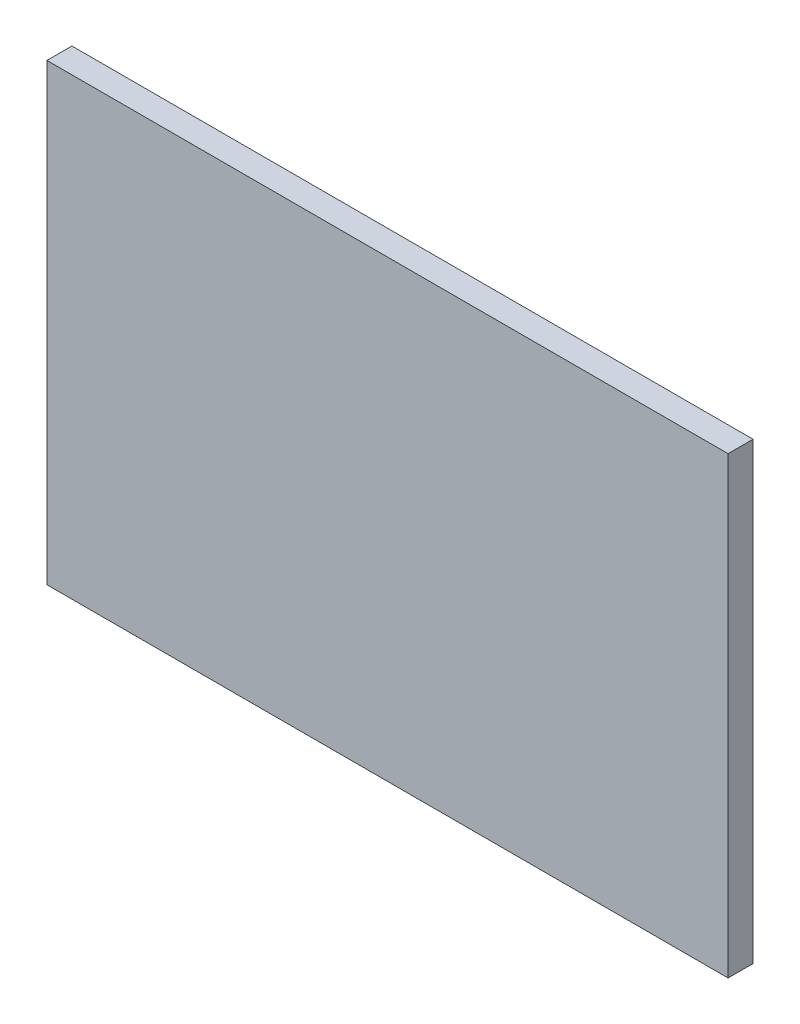
ISO-10303-21;
HEADER;
FILE_DESCRIPTION(('STEP AP214'),'2;1');
FILE_NAME('part.step','',(''),(''),'','','');
FILE_SCHEMA(('AUTOMOTIVE_DESIGN { 1 0 10303 214 1 1 1 1 }'));
ENDSEC;
DATA;
#1=APPLICATION_CONTEXT('core data for automotive mechanical design processes');
#2=APPLICATION_PROTOCOL_DEFINITION('international standard','automotive_design',2000,#1);
#3=PRODUCT_CONTEXT('',#1,'mechanical');
#4=PRODUCT('Part','Part','',(#3));
#5=PRODUCT_RELATED_PRODUCT_CATEGORY('part','',(#4));
#6=PRODUCT_DEFINITION_FORMATION('','',#4);
#7=PRODUCT_DEFINITION_CONTEXT('part definition',#1,'design');
#8=PRODUCT_DEFINITION('design','',#6,#7);
#9=PRODUCT_DEFINITION_SHAPE('','',#8);
#10=(LENGTH_UNIT() NAMED_UNIT(*) SI_UNIT(.MILLI.,.METRE.));
#11=(NAMED_UNIT(*) PLANE_ANGLE_UNIT() SI_UNIT($,.RADIAN.));
#12=(NAMED_UNIT(*) SI_UNIT($,.STERADIAN.) SOLID_ANGLE_UNIT());
#13=UNCERTAINTY_MEASURE_WITH_UNIT(LENGTH_MEASURE(1.E-05),#10,'distance_accuracy_value','');
#14=(GEOMETRIC_REPRESENTATION_CONTEXT(3) GLOBAL_UNCERTAINTY_ASSIGNED_CONTEXT((#13)) GLOBAL_UNIT_ASSIGNED_CONTEXT((#10,
#11,#12)) REPRESENTATION_CONTEXT('',''));
#15=CARTESIAN_POINT('',(0.,0.,0.));
#16=DIRECTION('',(0.,0.,1.));
#17=DIRECTION('',(1.,0.,0.));
#18=AXIS2_PLACEMENT_3D('',#15,#16,#17);
#19=CARTESIAN_POINT('',(-11.7512867860361,12.3093672866256,1.1));
#20=DIRECTION('',(1.,0.,0.));
#21=DIRECTION('',(0.,1.,0.));
#22=AXIS2_PLACEMENT_3D('',#19,#20,#21);
#23=PLANE('',#22);
#24=DIRECTION('',(0.,-1.,0.));
#25=VECTOR('',#24,1.);
#26=CARTESIAN_POINT('',(-11.7512867860361,12.3093672866256,0.));
#27=LINE('',#26,#25);
#28=CARTESIAN_POINT('',(-11.7512867860361,12.3093672866256,0.));
#29=VERTEX_POINT('',#28);
#30=CARTESIAN_POINT('',(-11.7512867860361,-7.69063271337441,0.));
#31=VERTEX_POINT('',#30);
#32=EDGE_CURVE('E98',#29,#31,#27,.T.);
#33=ORIENTED_EDGE('',*,*,#32,.T.);
#34=DIRECTION('',(0.,0.,-1.));
#35=VECTOR('',#34,1.);
#36=CARTESIAN_POINT('',(-11.7512867860361,-7.69063271337441,1.1));
#37=LINE('',#36,#35);
#38=CARTESIAN_POINT('',(-11.7512867860361,-7.69063271337441,1.1));
#39=VERTEX_POINT('',#38);
#40=EDGE_CURVE('E11',#39,#31,#37,.T.);
#41=ORIENTED_EDGE('',*,*,#40,.F.);
#42=DIRECTION('',(0.,-1.,0.));
#43=VECTOR('',#42,1.);
#44=CARTESIAN_POINT('',(-11.7512867860361,12.3093672866256,1.1));
#45=LINE('',#44,#43);
#46=CARTESIAN_POINT('',(-11.7512867860361,12.3093672866256,1.1));
#47=VERTEX_POINT('',#46);
#48=EDGE_CURVE('E86',#47,#39,#45,.T.);
#49=ORIENTED_EDGE('',*,*,#48,.F.);
#50=DIRECTION('',(0.,0.,-1.));
#51=VECTOR('',#50,1.);
#52=CARTESIAN_POINT('',(-11.7512867860361,12.3093672866256,1.1));
#53=LINE('',#52,#51);
#54=EDGE_CURVE('E94',#47,#29,#53,.T.);
#55=ORIENTED_EDGE('',*,*,#54,.T.);
#56=EDGE_LOOP('',(#33,#41,#49,#55));
#57=FACE_BOUND('',#56,.T.);
#58=ADVANCED_FACE('F35',(#57),#23,.F.);
#59=CARTESIAN_POINT('',(-11.7512867860361,-7.69063271337441,1.1));
#60=DIRECTION('',(0.,1.,0.));
#61=DIRECTION('',(0.,0.,1.));
#62=AXIS2_PLACEMENT_3D('',#59,#60,#61);
#63=PLANE('',#62);
#64=DIRECTION('',(1.,0.,0.));
#65=VECTOR('',#64,1.);
#66=CARTESIAN_POINT('',(-11.7512867860361,-7.69063271337441,0.));
#67=LINE('',#66,#65);
#68=CARTESIAN_POINT('',(18.2487132139639,-7.69063271337441,0.));
#69=VERTEX_POINT('',#68);
#70=EDGE_CURVE('E90',#31,#69,#67,.T.);
#71=ORIENTED_EDGE('',*,*,#70,.T.);
#72=DIRECTION('',(0.,0.,-1.));
#73=VECTOR('',#72,1.);
#74=CARTESIAN_POINT('',(18.2487132139639,-7.69063271337441,1.1));
#75=LINE('',#74,#73);
#76=CARTESIAN_POINT('',(18.2487132139639,-7.69063271337441,1.1));
#77=VERTEX_POINT('',#76);
#78=EDGE_CURVE('E43',#77,#69,#75,.T.);
#79=ORIENTED_EDGE('',*,*,#78,.F.);
#80=DIRECTION('',(1.,0.,0.));
#81=VECTOR('',#80,1.);
#82=CARTESIAN_POINT('',(-11.7512867860361,-7.69063271337441,1.1));
#83=LINE('',#82,#81);
#84=EDGE_CURVE('E81',#39,#77,#83,.T.);
#85=ORIENTED_EDGE('',*,*,#84,.F.);
#86=ORIENTED_EDGE('',*,*,#40,.T.);
#87=EDGE_LOOP('',(#71,#79,#85,#86));
#88=FACE_BOUND('',#87,.T.);
#89=ADVANCED_FACE('F89',(#88),#63,.F.);
#90=CARTESIAN_POINT('',(18.2487132139639,12.3093672866256,1.1));
#91=DIRECTION('',(-1.,0.,0.));
#92=DIRECTION('',(0.,-1.,0.));
#93=AXIS2_PLACEMENT_3D('',#90,#91,#92);
#94=PLANE('',#93);
#95=DIRECTION('',(0.,1.,0.));
#96=VECTOR('',#95,1.);
#97=CARTESIAN_POINT('',(18.2487132139639,12.3093672866256,0.));
#98=LINE('',#97,#96);
#99=CARTESIAN_POINT('',(18.2487132139639,12.3093672866256,0.));
#100=VERTEX_POINT('',#99);
#101=EDGE_CURVE('E68',#69,#100,#98,.T.);
#102=ORIENTED_EDGE('',*,*,#101,.T.);
#103=DIRECTION('',(0.,0.,-1.));
#104=VECTOR('',#103,1.);
#105=CARTESIAN_POINT('',(18.2487132139639,12.3093672866256,1.1));
#106=LINE('',#105,#104);
#107=CARTESIAN_POINT('',(18.2487132139639,12.3093672866256,1.1));
#108=VERTEX_POINT('',#107);
#109=EDGE_CURVE('E91',#108,#100,#106,.T.);
#110=ORIENTED_EDGE('',*,*,#109,.F.);
#111=DIRECTION('',(0.,1.,0.));
#112=VECTOR('',#111,1.);
#113=CARTESIAN_POINT('',(18.2487132139639,12.3093672866256,1.1));
#114=LINE('',#113,#112);
#115=EDGE_CURVE('E84',#77,#108,#114,.T.);
#116=ORIENTED_EDGE('',*,*,#115,.F.);
#117=ORIENTED_EDGE('',*,*,#78,.T.);
#118=EDGE_LOOP('',(#102,#110,#116,#117));
#119=FACE_BOUND('',#118,.T.);
#120=ADVANCED_FACE('F92',(#119),#94,.F.);
#121=CARTESIAN_POINT('',(-11.7512867860361,12.3093672866256,1.1));
#122=DIRECTION('',(0.,-1.,0.));
#123=DIRECTION('',(0.,0.,-1.));
#124=AXIS2_PLACEMENT_3D('',#121,#122,#123);
#125=PLANE('',#124);
#126=DIRECTION('',(-1.,0.,0.));
#127=VECTOR('',#126,1.);
#128=CARTESIAN_POINT('',(-11.7512867860361,12.3093672866256,0.));
#129=LINE('',#128,#127);
#130=EDGE_CURVE('E74',#100,#29,#129,.T.);
#131=ORIENTED_EDGE('',*,*,#130,.T.);
#132=ORIENTED_EDGE('',*,*,#54,.F.);
#133=DIRECTION('',(-1.,0.,0.));
#134=VECTOR('',#133,1.);
#135=CARTESIAN_POINT('',(-11.7512867860361,12.3093672866256,1.1));
#136=LINE('',#135,#134);
#137=EDGE_CURVE('E51',#108,#47,#136,.T.);
#138=ORIENTED_EDGE('',*,*,#137,.F.);
#139=ORIENTED_EDGE('',*,*,#109,.T.);
#140=EDGE_LOOP('',(#131,#132,#138,#139));
#141=FACE_BOUND('',#140,.T.);
#142=ADVANCED_FACE('F105',(#141),#125,.F.);
#143=CARTESIAN_POINT('',(0.,0.,1.1));
#144=DIRECTION('',(0.,0.,1.));
#145=DIRECTION('',(1.,0.,0.));
#146=AXIS2_PLACEMENT_3D('',#143,#144,#145);
#147=PLANE('',#146);
#148=ORIENTED_EDGE('',*,*,#48,.T.);
#149=ORIENTED_EDGE('',*,*,#84,.T.);
#150=ORIENTED_EDGE('',*,*,#115,.T.);
#151=ORIENTED_EDGE('',*,*,#137,.T.);
#152=EDGE_LOOP('',(#148,#149,#150,#151));
#153=FACE_BOUND('',#152,.T.);
#154=ADVANCED_FACE('F82',(#153),#147,.T.);
#155=CARTESIAN_POINT('',(0.,0.,0.));
#156=DIRECTION('',(0.,0.,1.));
#157=DIRECTION('',(1.,0.,0.));
#158=AXIS2_PLACEMENT_3D('',#155,#156,#157);
#159=PLANE('',#158);
#160=ORIENTED_EDGE('',*,*,#32,.F.);
#161=ORIENTED_EDGE('',*,*,#130,.F.);
#162=ORIENTED_EDGE('',*,*,#101,.F.);
#163=ORIENTED_EDGE('',*,*,#70,.F.);
#164=EDGE_LOOP('',(#160,#161,#162,#163));
#165=FACE_BOUND('',#164,.T.);
#166=ADVANCED_FACE('F108',(#165),#159,.F.);
#167=CLOSED_SHELL('',(#58,#89,#120,#142,#154,#166));
#168=MANIFOLD_SOLID_BREP('B2',#167);
#169=ADVANCED_BREP_SHAPE_REPRESENTATION('',(#18,#168),#14);
#170=SHAPE_DEFINITION_REPRESENTATION(#9,#169);
ENDSEC;
END-ISO-10303-21;
